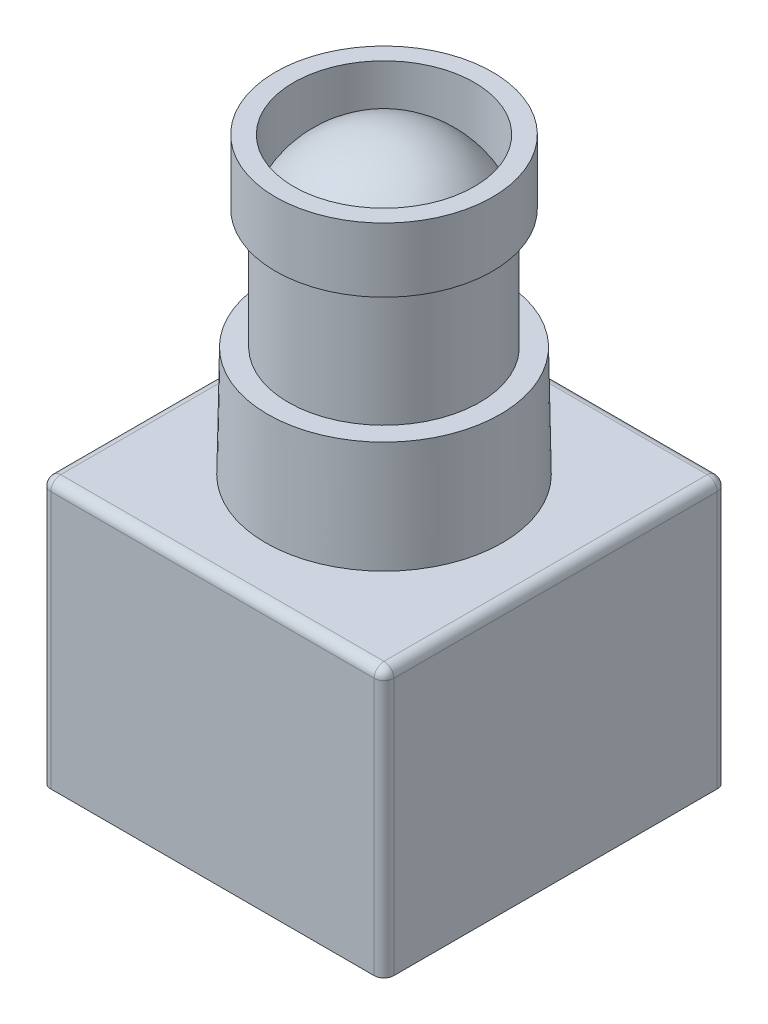
ISO-10303-21;
HEADER;
FILE_DESCRIPTION(('STEP AP214'),'2;1');
FILE_NAME('part.step','',(''),(''),'','','');
FILE_SCHEMA(('AUTOMOTIVE_DESIGN { 1 0 10303 214 1 1 1 1 }'));
ENDSEC;
DATA;
#1=APPLICATION_CONTEXT('core data for automotive mechanical design processes');
#2=APPLICATION_PROTOCOL_DEFINITION('international standard','automotive_design',2000,#1);
#3=PRODUCT_CONTEXT('',#1,'mechanical');
#4=PRODUCT('Part','Part','',(#3));
#5=PRODUCT_RELATED_PRODUCT_CATEGORY('part','',(#4));
#6=PRODUCT_DEFINITION_FORMATION('','',#4);
#7=PRODUCT_DEFINITION_CONTEXT('part definition',#1,'design');
#8=PRODUCT_DEFINITION('design','',#6,#7);
#9=PRODUCT_DEFINITION_SHAPE('','',#8);
#10=(LENGTH_UNIT() NAMED_UNIT(*) SI_UNIT(.MILLI.,.METRE.));
#11=(NAMED_UNIT(*) PLANE_ANGLE_UNIT() SI_UNIT($,.RADIAN.));
#12=(NAMED_UNIT(*) SI_UNIT($,.STERADIAN.) SOLID_ANGLE_UNIT());
#13=UNCERTAINTY_MEASURE_WITH_UNIT(LENGTH_MEASURE(1.E-05),#10,'distance_accuracy_value','');
#14=(GEOMETRIC_REPRESENTATION_CONTEXT(3) GLOBAL_UNCERTAINTY_ASSIGNED_CONTEXT((#13)) GLOBAL_UNIT_ASSIGNED_CONTEXT((#10,
#11,#12)) REPRESENTATION_CONTEXT('',''));
#15=CARTESIAN_POINT('',(0.,0.,0.));
#16=DIRECTION('',(0.,0.,1.));
#17=DIRECTION('',(1.,0.,0.));
#18=AXIS2_PLACEMENT_3D('',#15,#16,#17);
#19=CARTESIAN_POINT('',(11.049,24.3332,-11.049));
#20=DIRECTION('',(0.,1.,0.));
#21=DIRECTION('',(0.,0.,1.));
#22=AXIS2_PLACEMENT_3D('',#19,#20,#21);
#23=PLANE('',#22);
#24=CARTESIAN_POINT('',(11.049,24.3332,-11.049));
#25=DIRECTION('',(0.,1.,0.));
#26=DIRECTION('',(0.,0.,1.));
#27=AXIS2_PLACEMENT_3D('',#24,#25,#26);
#28=CIRCLE('',#27,7.49585957823051);
#29=CARTESIAN_POINT('',(11.049,24.3332,-3.55314042176949));
#30=VERTEX_POINT('',#29);
#31=EDGE_CURVE('E121',#30,#30,#28,.T.);
#32=ORIENTED_EDGE('',*,*,#31,.T.);
#33=EDGE_LOOP('',(#32));
#34=FACE_BOUND('',#33,.T.);
#35=CARTESIAN_POINT('',(11.049,24.3332,-11.049));
#36=DIRECTION('',(0.,1.,0.));
#37=DIRECTION('',(0.,0.,1.));
#38=AXIS2_PLACEMENT_3D('',#35,#36,#37);
#39=CIRCLE('',#38,6.16511776478347);
#40=CARTESIAN_POINT('',(11.049,24.3332,-4.88388223521653));
#41=VERTEX_POINT('',#40);
#42=EDGE_CURVE('E497',#41,#41,#39,.T.);
#43=ORIENTED_EDGE('',*,*,#42,.F.);
#44=EDGE_LOOP('',(#43));
#45=FACE_BOUND('',#44,.T.);
#46=ADVANCED_FACE('F32',(#34,#45),#23,.T.);
#47=CARTESIAN_POINT('',(0.,17.2212,-22.098));
#48=DIRECTION('',(0.,-1.,0.));
#49=DIRECTION('',(0.,0.,-1.));
#50=AXIS2_PLACEMENT_3D('',#47,#48,#49);
#51=PLANE('',#50);
#52=DIRECTION('',(0.,0.,-1.));
#53=VECTOR('',#52,1.);
#54=CARTESIAN_POINT('',(21.463,17.2212,-22.098));
#55=LINE('',#54,#53);
#56=CARTESIAN_POINT('',(21.463,17.2212,-0.635));
#57=VERTEX_POINT('',#56);
#58=CARTESIAN_POINT('',(21.463,17.2212,-21.463));
#59=VERTEX_POINT('',#58);
#60=EDGE_CURVE('E145',#57,#59,#55,.T.);
#61=ORIENTED_EDGE('',*,*,#60,.T.);
#62=DIRECTION('',(-1.,0.,0.));
#63=VECTOR('',#62,1.);
#64=CARTESIAN_POINT('',(0.,17.2212,-21.463));
#65=LINE('',#64,#63);
#66=CARTESIAN_POINT('',(0.634999999999993,17.2212,-21.463));
#67=VERTEX_POINT('',#66);
#68=EDGE_CURVE('E115',#59,#67,#65,.T.);
#69=ORIENTED_EDGE('',*,*,#68,.T.);
#70=DIRECTION('',(0.,0.,1.));
#71=VECTOR('',#70,1.);
#72=CARTESIAN_POINT('',(0.634999999999993,17.2212,-22.098));
#73=LINE('',#72,#71);
#74=CARTESIAN_POINT('',(0.635,17.2212,-0.635));
#75=VERTEX_POINT('',#74);
#76=EDGE_CURVE('E133',#67,#75,#73,.T.);
#77=ORIENTED_EDGE('',*,*,#76,.T.);
#78=DIRECTION('',(1.,0.,0.));
#79=VECTOR('',#78,1.);
#80=CARTESIAN_POINT('',(0.,17.2212,-0.635));
#81=LINE('',#80,#79);
#82=EDGE_CURVE('E139',#75,#57,#81,.T.);
#83=ORIENTED_EDGE('',*,*,#82,.T.);
#84=EDGE_LOOP('',(#61,#69,#77,#83));
#85=FACE_BOUND('',#84,.T.);
#86=CARTESIAN_POINT('',(11.049,17.2212,-11.049));
#87=DIRECTION('',(0.,-1.,0.));
#88=DIRECTION('',(0.,0.,-1.));
#89=AXIS2_PLACEMENT_3D('',#86,#87,#88);
#90=CIRCLE('',#89,7.62);
#91=CARTESIAN_POINT('',(11.049,17.2212,-18.669));
#92=VERTEX_POINT('',#91);
#93=EDGE_CURVE('E11',#92,#92,#90,.F.);
#94=ORIENTED_EDGE('',*,*,#93,.F.);
#95=EDGE_LOOP('',(#94));
#96=FACE_BOUND('',#95,.T.);
#97=ADVANCED_FACE('F142',(#85,#96),#51,.F.);
#98=CARTESIAN_POINT('',(0.,17.2212,0.));
#99=DIRECTION('',(1.,0.,0.));
#100=DIRECTION('',(0.,0.,-1.));
#101=AXIS2_PLACEMENT_3D('',#98,#99,#100);
#102=PLANE('',#101);
#103=DIRECTION('',(0.,0.,1.));
#104=VECTOR('',#103,1.);
#105=CARTESIAN_POINT('',(0.,16.5862,0.));
#106=LINE('',#105,#104);
#107=CARTESIAN_POINT('',(0.,16.5862,-0.635));
#108=VERTEX_POINT('',#107);
#109=CARTESIAN_POINT('',(0.,16.5862,-21.463));
#110=VERTEX_POINT('',#109);
#111=EDGE_CURVE('E48',#108,#110,#106,.F.);
#112=ORIENTED_EDGE('',*,*,#111,.T.);
#113=DIRECTION('',(0.,-1.,0.));
#114=VECTOR('',#113,1.);
#115=CARTESIAN_POINT('',(0.,17.2212,-21.463));
#116=LINE('',#115,#114);
#117=CARTESIAN_POINT('',(0.,0.,-21.463));
#118=VERTEX_POINT('',#117);
#119=EDGE_CURVE('E170',#110,#118,#116,.T.);
#120=ORIENTED_EDGE('',*,*,#119,.T.);
#121=DIRECTION('',(0.,0.,1.));
#122=VECTOR('',#121,1.);
#123=CARTESIAN_POINT('',(0.,0.,0.));
#124=LINE('',#123,#122);
#125=CARTESIAN_POINT('',(0.,0.,-0.635));
#126=VERTEX_POINT('',#125);
#127=EDGE_CURVE('E201',#118,#126,#124,.T.);
#128=ORIENTED_EDGE('',*,*,#127,.T.);
#129=DIRECTION('',(0.,-1.,0.));
#130=VECTOR('',#129,1.);
#131=CARTESIAN_POINT('',(0.,17.2212,-0.635));
#132=LINE('',#131,#130);
#133=EDGE_CURVE('E53',#126,#108,#132,.F.);
#134=ORIENTED_EDGE('',*,*,#133,.T.);
#135=EDGE_LOOP('',(#112,#120,#128,#134));
#136=FACE_BOUND('',#135,.T.);
#137=ADVANCED_FACE('F242',(#136),#102,.F.);
#138=CARTESIAN_POINT('',(0.,17.2212,0.));
#139=DIRECTION('',(0.,0.,-1.));
#140=DIRECTION('',(-1.,0.,0.));
#141=AXIS2_PLACEMENT_3D('',#138,#139,#140);
#142=PLANE('',#141);
#143=DIRECTION('',(1.,0.,0.));
#144=VECTOR('',#143,1.);
#145=CARTESIAN_POINT('',(0.,0.,0.));
#146=LINE('',#145,#144);
#147=CARTESIAN_POINT('',(0.635,0.,0.));
#148=VERTEX_POINT('',#147);
#149=CARTESIAN_POINT('',(21.463,0.,0.));
#150=VERTEX_POINT('',#149);
#151=EDGE_CURVE('E205',#148,#150,#146,.T.);
#152=ORIENTED_EDGE('',*,*,#151,.T.);
#153=DIRECTION('',(0.,-1.,0.));
#154=VECTOR('',#153,1.);
#155=CARTESIAN_POINT('',(21.463,17.2212,0.));
#156=LINE('',#155,#154);
#157=CARTESIAN_POINT('',(21.463,16.5862,0.));
#158=VERTEX_POINT('',#157);
#159=EDGE_CURVE('E166',#150,#158,#156,.F.);
#160=ORIENTED_EDGE('',*,*,#159,.T.);
#161=DIRECTION('',(1.,0.,0.));
#162=VECTOR('',#161,1.);
#163=CARTESIAN_POINT('',(0.,16.5862,0.));
#164=LINE('',#163,#162);
#165=CARTESIAN_POINT('',(0.635,16.5862,0.));
#166=VERTEX_POINT('',#165);
#167=EDGE_CURVE('E164',#158,#166,#164,.F.);
#168=ORIENTED_EDGE('',*,*,#167,.T.);
#169=DIRECTION('',(0.,-1.,0.));
#170=VECTOR('',#169,1.);
#171=CARTESIAN_POINT('',(0.635,17.2212,0.));
#172=LINE('',#171,#170);
#173=EDGE_CURVE('E162',#166,#148,#172,.T.);
#174=ORIENTED_EDGE('',*,*,#173,.T.);
#175=EDGE_LOOP('',(#152,#160,#168,#174));
#176=FACE_BOUND('',#175,.T.);
#177=ADVANCED_FACE('F285',(#176),#142,.F.);
#178=CARTESIAN_POINT('',(22.098,17.2212,0.));
#179=DIRECTION('',(-1.,0.,0.));
#180=DIRECTION('',(0.,0.,1.));
#181=AXIS2_PLACEMENT_3D('',#178,#179,#180);
#182=PLANE('',#181);
#183=DIRECTION('',(0.,0.,-1.));
#184=VECTOR('',#183,1.);
#185=CARTESIAN_POINT('',(22.098,0.,0.));
#186=LINE('',#185,#184);
#187=CARTESIAN_POINT('',(22.098,0.,-0.635));
#188=VERTEX_POINT('',#187);
#189=CARTESIAN_POINT('',(22.098,0.,-21.463));
#190=VERTEX_POINT('',#189);
#191=EDGE_CURVE('E209',#188,#190,#186,.T.);
#192=ORIENTED_EDGE('',*,*,#191,.T.);
#193=DIRECTION('',(0.,-1.,0.));
#194=VECTOR('',#193,1.);
#195=CARTESIAN_POINT('',(22.098,17.2212,-21.463));
#196=LINE('',#195,#194);
#197=CARTESIAN_POINT('',(22.098,16.5862,-21.463));
#198=VERTEX_POINT('',#197);
#199=EDGE_CURVE('E160',#190,#198,#196,.F.);
#200=ORIENTED_EDGE('',*,*,#199,.T.);
#201=DIRECTION('',(0.,0.,-1.));
#202=VECTOR('',#201,1.);
#203=CARTESIAN_POINT('',(22.098,16.5862,0.));
#204=LINE('',#203,#202);
#205=CARTESIAN_POINT('',(22.098,16.5862,-0.635));
#206=VERTEX_POINT('',#205);
#207=EDGE_CURVE('E158',#198,#206,#204,.F.);
#208=ORIENTED_EDGE('',*,*,#207,.T.);
#209=DIRECTION('',(0.,-1.,0.));
#210=VECTOR('',#209,1.);
#211=CARTESIAN_POINT('',(22.098,17.2212,-0.635));
#212=LINE('',#211,#210);
#213=EDGE_CURVE('E156',#206,#188,#212,.T.);
#214=ORIENTED_EDGE('',*,*,#213,.T.);
#215=EDGE_LOOP('',(#192,#200,#208,#214));
#216=FACE_BOUND('',#215,.T.);
#217=ADVANCED_FACE('F282',(#216),#182,.F.);
#218=CARTESIAN_POINT('',(0.,17.2212,-22.098));
#219=DIRECTION('',(0.,0.,1.));
#220=DIRECTION('',(1.,0.,0.));
#221=AXIS2_PLACEMENT_3D('',#218,#219,#220);
#222=PLANE('',#221);
#223=DIRECTION('',(-1.,0.,0.));
#224=VECTOR('',#223,1.);
#225=CARTESIAN_POINT('',(0.,0.,-22.098));
#226=LINE('',#225,#224);
#227=CARTESIAN_POINT('',(21.463,0.,-22.098));
#228=VERTEX_POINT('',#227);
#229=CARTESIAN_POINT('',(0.634999999999993,0.,-22.098));
#230=VERTEX_POINT('',#229);
#231=EDGE_CURVE('E140',#228,#230,#226,.T.);
#232=ORIENTED_EDGE('',*,*,#231,.T.);
#233=DIRECTION('',(0.,-1.,0.));
#234=VECTOR('',#233,1.);
#235=CARTESIAN_POINT('',(0.634999999999993,17.2212,-22.098));
#236=LINE('',#235,#234);
#237=CARTESIAN_POINT('',(0.634999999999993,16.5862,-22.098));
#238=VERTEX_POINT('',#237);
#239=EDGE_CURVE('E154',#230,#238,#236,.F.);
#240=ORIENTED_EDGE('',*,*,#239,.T.);
#241=DIRECTION('',(-1.,0.,0.));
#242=VECTOR('',#241,1.);
#243=CARTESIAN_POINT('',(0.,16.5862,-22.098));
#244=LINE('',#243,#242);
#245=CARTESIAN_POINT('',(21.463,16.5862,-22.098));
#246=VERTEX_POINT('',#245);
#247=EDGE_CURVE('E117',#238,#246,#244,.F.);
#248=ORIENTED_EDGE('',*,*,#247,.T.);
#249=DIRECTION('',(0.,-1.,0.));
#250=VECTOR('',#249,1.);
#251=CARTESIAN_POINT('',(21.463,17.2212,-22.098));
#252=LINE('',#251,#250);
#253=EDGE_CURVE('E147',#246,#228,#252,.T.);
#254=ORIENTED_EDGE('',*,*,#253,.T.);
#255=EDGE_LOOP('',(#232,#240,#248,#254));
#256=FACE_BOUND('',#255,.T.);
#257=ADVANCED_FACE('F237',(#256),#222,.F.);
#258=CARTESIAN_POINT('',(0.,0.,-22.098));
#259=DIRECTION('',(0.,-1.,0.));
#260=DIRECTION('',(0.,0.,-1.));
#261=AXIS2_PLACEMENT_3D('',#258,#259,#260);
#262=PLANE('',#261);
#263=ORIENTED_EDGE('',*,*,#127,.F.);
#264=CARTESIAN_POINT('',(0.634999999999993,0.,-21.463));
#265=DIRECTION('',(0.,-1.,0.));
#266=DIRECTION('',(0.,0.,-1.));
#267=AXIS2_PLACEMENT_3D('',#264,#265,#266);
#268=CIRCLE('',#267,0.635);
#269=EDGE_CURVE('E41',#118,#230,#268,.T.);
#270=ORIENTED_EDGE('',*,*,#269,.T.);
#271=ORIENTED_EDGE('',*,*,#231,.F.);
#272=CARTESIAN_POINT('',(21.463,0.,-21.463));
#273=DIRECTION('',(0.,-1.,0.));
#274=DIRECTION('',(0.,0.,-1.));
#275=AXIS2_PLACEMENT_3D('',#272,#273,#274);
#276=CIRCLE('',#275,0.635);
#277=EDGE_CURVE('E176',#228,#190,#276,.T.);
#278=ORIENTED_EDGE('',*,*,#277,.T.);
#279=ORIENTED_EDGE('',*,*,#191,.F.);
#280=CARTESIAN_POINT('',(21.463,0.,-0.635));
#281=DIRECTION('',(0.,-1.,0.));
#282=DIRECTION('',(0.,0.,-1.));
#283=AXIS2_PLACEMENT_3D('',#280,#281,#282);
#284=CIRCLE('',#283,0.635);
#285=EDGE_CURVE('E174',#188,#150,#284,.T.);
#286=ORIENTED_EDGE('',*,*,#285,.T.);
#287=ORIENTED_EDGE('',*,*,#151,.F.);
#288=CARTESIAN_POINT('',(0.635,0.,-0.635));
#289=DIRECTION('',(0.,-1.,0.));
#290=DIRECTION('',(0.,0.,-1.));
#291=AXIS2_PLACEMENT_3D('',#288,#289,#290);
#292=CIRCLE('',#291,0.635);
#293=EDGE_CURVE('E172',#148,#126,#292,.T.);
#294=ORIENTED_EDGE('',*,*,#293,.T.);
#295=EDGE_LOOP('',(#263,#270,#271,#278,#279,#286,#287,#294));
#296=FACE_BOUND('',#295,.T.);
#297=ADVANCED_FACE('F244',(#296),#262,.T.);
#298=CARTESIAN_POINT('',(21.463,17.2212,-0.635));
#299=DIRECTION('',(0.,-1.,0.));
#300=DIRECTION('',(0.,0.,-1.));
#301=AXIS2_PLACEMENT_3D('',#298,#299,#300);
#302=CYLINDRICAL_SURFACE('',#301,0.635);
#303=ORIENTED_EDGE('',*,*,#285,.F.);
#304=ORIENTED_EDGE('',*,*,#213,.F.);
#305=CARTESIAN_POINT('',(21.463,16.5862,-0.635));
#306=DIRECTION('',(0.,1.,0.));
#307=DIRECTION('',(0.,0.,1.));
#308=AXIS2_PLACEMENT_3D('',#305,#306,#307);
#309=CIRCLE('',#308,0.635);
#310=EDGE_CURVE('E199',#158,#206,#309,.T.);
#311=ORIENTED_EDGE('',*,*,#310,.F.);
#312=ORIENTED_EDGE('',*,*,#159,.F.);
#313=EDGE_LOOP('',(#303,#304,#311,#312));
#314=FACE_BOUND('',#313,.T.);
#315=ADVANCED_FACE('F279',(#314),#302,.T.);
#316=CARTESIAN_POINT('',(0.,16.5862,-0.635));
#317=DIRECTION('',(1.,0.,0.));
#318=DIRECTION('',(0.,0.,-1.));
#319=AXIS2_PLACEMENT_3D('',#316,#317,#318);
#320=CYLINDRICAL_SURFACE('',#319,0.635);
#321=CARTESIAN_POINT('',(0.635,16.5862,-0.635));
#322=DIRECTION('',(-1.,0.,0.));
#323=DIRECTION('',(0.,0.,1.));
#324=AXIS2_PLACEMENT_3D('',#321,#322,#323);
#325=CIRCLE('',#324,0.635);
#326=EDGE_CURVE('E193',#166,#75,#325,.T.);
#327=ORIENTED_EDGE('',*,*,#326,.F.);
#328=ORIENTED_EDGE('',*,*,#167,.F.);
#329=CARTESIAN_POINT('',(21.463,16.5862,-0.635));
#330=DIRECTION('',(1.,0.,0.));
#331=DIRECTION('',(0.,0.,-1.));
#332=AXIS2_PLACEMENT_3D('',#329,#330,#331);
#333=CIRCLE('',#332,0.635);
#334=EDGE_CURVE('E196',#57,#158,#333,.T.);
#335=ORIENTED_EDGE('',*,*,#334,.F.);
#336=ORIENTED_EDGE('',*,*,#82,.F.);
#337=EDGE_LOOP('',(#327,#328,#335,#336));
#338=FACE_BOUND('',#337,.T.);
#339=ADVANCED_FACE('F221',(#338),#320,.T.);
#340=CARTESIAN_POINT('',(0.635,17.2212,-0.635));
#341=DIRECTION('',(0.,-1.,0.));
#342=DIRECTION('',(0.,0.,-1.));
#343=AXIS2_PLACEMENT_3D('',#340,#341,#342);
#344=CYLINDRICAL_SURFACE('',#343,0.635);
#345=ORIENTED_EDGE('',*,*,#293,.F.);
#346=ORIENTED_EDGE('',*,*,#173,.F.);
#347=CARTESIAN_POINT('',(0.635,16.5862,-0.635));
#348=DIRECTION('',(0.,1.,0.));
#349=DIRECTION('',(0.,0.,1.));
#350=AXIS2_PLACEMENT_3D('',#347,#348,#349);
#351=CIRCLE('',#350,0.635);
#352=EDGE_CURVE('E190',#108,#166,#351,.T.);
#353=ORIENTED_EDGE('',*,*,#352,.F.);
#354=ORIENTED_EDGE('',*,*,#133,.F.);
#355=EDGE_LOOP('',(#345,#346,#353,#354));
#356=FACE_BOUND('',#355,.T.);
#357=ADVANCED_FACE('F249',(#356),#344,.T.);
#358=CARTESIAN_POINT('',(21.463,16.5862,-0.635));
#359=DIRECTION('',(0.,0.,1.));
#360=DIRECTION('',(1.,0.,0.));
#361=AXIS2_PLACEMENT_3D('',#358,#359,#360);
#362=SPHERICAL_SURFACE('',#361,0.635);
#363=ORIENTED_EDGE('',*,*,#334,.T.);
#364=ORIENTED_EDGE('',*,*,#310,.T.);
#365=CARTESIAN_POINT('',(21.463,16.5862,-0.635));
#366=DIRECTION('',(0.,0.,1.));
#367=DIRECTION('',(1.,0.,0.));
#368=AXIS2_PLACEMENT_3D('',#365,#366,#367);
#369=CIRCLE('',#368,0.635);
#370=EDGE_CURVE('E187',#57,#206,#369,.F.);
#371=ORIENTED_EDGE('',*,*,#370,.F.);
#372=EDGE_LOOP('',(#363,#364,#371));
#373=FACE_BOUND('',#372,.T.);
#374=ADVANCED_FACE('F222',(#373),#362,.T.);
#375=CARTESIAN_POINT('',(0.635,16.5862,-0.635));
#376=DIRECTION('',(0.,0.,1.));
#377=DIRECTION('',(1.,0.,0.));
#378=AXIS2_PLACEMENT_3D('',#375,#376,#377);
#379=SPHERICAL_SURFACE('',#378,0.635);
#380=ORIENTED_EDGE('',*,*,#352,.T.);
#381=ORIENTED_EDGE('',*,*,#326,.T.);
#382=CARTESIAN_POINT('',(0.635,16.5862,-0.635));
#383=DIRECTION('',(0.,0.,1.));
#384=DIRECTION('',(1.,0.,0.));
#385=AXIS2_PLACEMENT_3D('',#382,#383,#384);
#386=CIRCLE('',#385,0.635);
#387=EDGE_CURVE('E136',#108,#75,#386,.F.);
#388=ORIENTED_EDGE('',*,*,#387,.F.);
#389=EDGE_LOOP('',(#380,#381,#388));
#390=FACE_BOUND('',#389,.T.);
#391=ADVANCED_FACE('F251',(#390),#379,.T.);
#392=CARTESIAN_POINT('',(21.463,17.2212,-21.463));
#393=DIRECTION('',(0.,-1.,0.));
#394=DIRECTION('',(0.,0.,-1.));
#395=AXIS2_PLACEMENT_3D('',#392,#393,#394);
#396=CYLINDRICAL_SURFACE('',#395,0.635);
#397=ORIENTED_EDGE('',*,*,#277,.F.);
#398=ORIENTED_EDGE('',*,*,#253,.F.);
#399=CARTESIAN_POINT('',(21.463,16.5862,-21.463));
#400=DIRECTION('',(0.,1.,0.));
#401=DIRECTION('',(0.,0.,1.));
#402=AXIS2_PLACEMENT_3D('',#399,#400,#401);
#403=CIRCLE('',#402,0.635);
#404=EDGE_CURVE('E183',#198,#246,#403,.T.);
#405=ORIENTED_EDGE('',*,*,#404,.F.);
#406=ORIENTED_EDGE('',*,*,#199,.F.);
#407=EDGE_LOOP('',(#397,#398,#405,#406));
#408=FACE_BOUND('',#407,.T.);
#409=ADVANCED_FACE('F234',(#408),#396,.T.);
#410=CARTESIAN_POINT('',(21.463,16.5862,-22.098));
#411=DIRECTION('',(0.,0.,-1.));
#412=DIRECTION('',(-1.,0.,0.));
#413=AXIS2_PLACEMENT_3D('',#410,#411,#412);
#414=CYLINDRICAL_SURFACE('',#413,0.635);
#415=ORIENTED_EDGE('',*,*,#370,.T.);
#416=ORIENTED_EDGE('',*,*,#207,.F.);
#417=CARTESIAN_POINT('',(21.463,16.5862,-21.463));
#418=DIRECTION('',(0.,0.,-1.));
#419=DIRECTION('',(-1.,0.,0.));
#420=AXIS2_PLACEMENT_3D('',#417,#418,#419);
#421=CIRCLE('',#420,0.635);
#422=EDGE_CURVE('E130',#59,#198,#421,.T.);
#423=ORIENTED_EDGE('',*,*,#422,.F.);
#424=ORIENTED_EDGE('',*,*,#60,.F.);
#425=EDGE_LOOP('',(#415,#416,#423,#424));
#426=FACE_BOUND('',#425,.T.);
#427=ADVANCED_FACE('F225',(#426),#414,.T.);
#428=CARTESIAN_POINT('',(0.634999999999993,16.5862,-22.098));
#429=DIRECTION('',(0.,0.,1.));
#430=DIRECTION('',(1.,0.,0.));
#431=AXIS2_PLACEMENT_3D('',#428,#429,#430);
#432=CYLINDRICAL_SURFACE('',#431,0.635);
#433=ORIENTED_EDGE('',*,*,#387,.T.);
#434=ORIENTED_EDGE('',*,*,#76,.F.);
#435=CARTESIAN_POINT('',(0.634999999999993,16.5862,-21.463));
#436=DIRECTION('',(0.,0.,-1.));
#437=DIRECTION('',(-1.,0.,0.));
#438=AXIS2_PLACEMENT_3D('',#435,#436,#437);
#439=CIRCLE('',#438,0.635);
#440=EDGE_CURVE('E124',#110,#67,#439,.T.);
#441=ORIENTED_EDGE('',*,*,#440,.F.);
#442=ORIENTED_EDGE('',*,*,#111,.F.);
#443=EDGE_LOOP('',(#433,#434,#441,#442));
#444=FACE_BOUND('',#443,.T.);
#445=ADVANCED_FACE('F134',(#444),#432,.T.);
#446=CARTESIAN_POINT('',(0.634999999999993,17.2212,-21.463));
#447=DIRECTION('',(0.,-1.,0.));
#448=DIRECTION('',(0.,0.,-1.));
#449=AXIS2_PLACEMENT_3D('',#446,#447,#448);
#450=CYLINDRICAL_SURFACE('',#449,0.635);
#451=ORIENTED_EDGE('',*,*,#269,.F.);
#452=ORIENTED_EDGE('',*,*,#119,.F.);
#453=CARTESIAN_POINT('',(0.634999999999993,16.5862,-21.463));
#454=DIRECTION('',(0.,1.,0.));
#455=DIRECTION('',(0.,0.,1.));
#456=AXIS2_PLACEMENT_3D('',#453,#454,#455);
#457=CIRCLE('',#456,0.635);
#458=EDGE_CURVE('E128',#238,#110,#457,.T.);
#459=ORIENTED_EDGE('',*,*,#458,.F.);
#460=ORIENTED_EDGE('',*,*,#239,.F.);
#461=EDGE_LOOP('',(#451,#452,#459,#460));
#462=FACE_BOUND('',#461,.T.);
#463=ADVANCED_FACE('F241',(#462),#450,.T.);
#464=CARTESIAN_POINT('',(21.463,16.5862,-21.463));
#465=DIRECTION('',(0.,0.,1.));
#466=DIRECTION('',(1.,0.,0.));
#467=AXIS2_PLACEMENT_3D('',#464,#465,#466);
#468=SPHERICAL_SURFACE('',#467,0.635);
#469=ORIENTED_EDGE('',*,*,#422,.T.);
#470=ORIENTED_EDGE('',*,*,#404,.T.);
#471=CARTESIAN_POINT('',(21.463,16.5862,-21.463));
#472=DIRECTION('',(1.,0.,0.));
#473=DIRECTION('',(0.,0.,-1.));
#474=AXIS2_PLACEMENT_3D('',#471,#472,#473);
#475=CIRCLE('',#474,0.635);
#476=EDGE_CURVE('E120',#59,#246,#475,.F.);
#477=ORIENTED_EDGE('',*,*,#476,.F.);
#478=EDGE_LOOP('',(#469,#470,#477));
#479=FACE_BOUND('',#478,.T.);
#480=ADVANCED_FACE('F229',(#479),#468,.T.);
#481=CARTESIAN_POINT('',(0.634999999999993,16.5862,-21.463));
#482=DIRECTION('',(0.,0.,1.));
#483=DIRECTION('',(1.,0.,0.));
#484=AXIS2_PLACEMENT_3D('',#481,#482,#483);
#485=SPHERICAL_SURFACE('',#484,0.635);
#486=ORIENTED_EDGE('',*,*,#458,.T.);
#487=ORIENTED_EDGE('',*,*,#440,.T.);
#488=CARTESIAN_POINT('',(0.634999999999993,16.5862,-21.463));
#489=DIRECTION('',(-1.,0.,0.));
#490=DIRECTION('',(0.,0.,1.));
#491=AXIS2_PLACEMENT_3D('',#488,#489,#490);
#492=CIRCLE('',#491,0.635);
#493=EDGE_CURVE('E111',#238,#67,#492,.F.);
#494=ORIENTED_EDGE('',*,*,#493,.F.);
#495=EDGE_LOOP('',(#486,#487,#494));
#496=FACE_BOUND('',#495,.T.);
#497=ADVANCED_FACE('F126',(#496),#485,.T.);
#498=CARTESIAN_POINT('',(0.,16.5862,-21.463));
#499=DIRECTION('',(-1.,0.,0.));
#500=DIRECTION('',(0.,0.,1.));
#501=AXIS2_PLACEMENT_3D('',#498,#499,#500);
#502=CYLINDRICAL_SURFACE('',#501,0.635);
#503=ORIENTED_EDGE('',*,*,#476,.T.);
#504=ORIENTED_EDGE('',*,*,#247,.F.);
#505=ORIENTED_EDGE('',*,*,#493,.T.);
#506=ORIENTED_EDGE('',*,*,#68,.F.);
#507=EDGE_LOOP('',(#503,#504,#505,#506));
#508=FACE_BOUND('',#507,.T.);
#509=ADVANCED_FACE('F113',(#508),#502,.T.);
#510=CARTESIAN_POINT('',(11.049,17.2212,-11.049));
#511=DIRECTION('',(0.,-1.,0.));
#512=DIRECTION('',(0.,0.,1.));
#513=AXIS2_PLACEMENT_3D('',#510,#511,#512);
#514=CONICAL_SURFACE('',#513,7.62,0.0174532925199434);
#515=ORIENTED_EDGE('',*,*,#31,.F.);
#516=EDGE_LOOP('',(#515));
#517=FACE_BOUND('',#516,.T.);
#518=ORIENTED_EDGE('',*,*,#93,.T.);
#519=EDGE_LOOP('',(#518));
#520=FACE_BOUND('',#519,.T.);
#521=ADVANCED_FACE('F273',(#517,#520),#514,.T.);
#522=CARTESIAN_POINT('',(11.049,32.0548,-11.049));
#523=DIRECTION('',(0.,-1.,0.));
#524=DIRECTION('',(0.,0.,-1.));
#525=AXIS2_PLACEMENT_3D('',#522,#523,#524);
#526=CYLINDRICAL_SURFACE('',#525,6.16511776478347);
#527=CARTESIAN_POINT('',(11.049,32.0548,-11.049));
#528=DIRECTION('',(0.,1.,0.));
#529=DIRECTION('',(0.,0.,1.));
#530=AXIS2_PLACEMENT_3D('',#527,#528,#529);
#531=CIRCLE('',#530,6.16511776478347);
#532=CARTESIAN_POINT('',(11.049,32.0548,-4.88388223521653));
#533=VERTEX_POINT('',#532);
#534=EDGE_CURVE('E499',#533,#533,#531,.T.);
#535=ORIENTED_EDGE('',*,*,#534,.F.);
#536=EDGE_LOOP('',(#535));
#537=FACE_BOUND('',#536,.T.);
#538=ORIENTED_EDGE('',*,*,#42,.T.);
#539=EDGE_LOOP('',(#538));
#540=FACE_BOUND('',#539,.T.);
#541=ADVANCED_FACE('F271',(#537,#540),#526,.T.);
#542=CARTESIAN_POINT('',(11.049,32.0548,-11.049));
#543=DIRECTION('',(0.,1.,0.));
#544=DIRECTION('',(0.,0.,1.));
#545=AXIS2_PLACEMENT_3D('',#542,#543,#544);
#546=PLANE('',#545);
#547=CARTESIAN_POINT('',(11.049,32.0548,-11.049));
#548=DIRECTION('',(0.,1.,0.));
#549=DIRECTION('',(0.,0.,1.));
#550=AXIS2_PLACEMENT_3D('',#547,#548,#549);
#551=CIRCLE('',#550,6.985);
#552=CARTESIAN_POINT('',(11.049,32.0548,-4.064));
#553=VERTEX_POINT('',#552);
#554=EDGE_CURVE('E486',#553,#553,#551,.T.);
#555=ORIENTED_EDGE('',*,*,#554,.F.);
#556=EDGE_LOOP('',(#555));
#557=FACE_BOUND('',#556,.T.);
#558=ORIENTED_EDGE('',*,*,#534,.T.);
#559=EDGE_LOOP('',(#558));
#560=FACE_BOUND('',#559,.T.);
#561=ADVANCED_FACE('F338',(#557,#560),#546,.F.);
#562=CARTESIAN_POINT('',(11.049,36.195,-11.049));
#563=DIRECTION('',(0.,-1.,0.));
#564=DIRECTION('',(0.,0.,-1.));
#565=AXIS2_PLACEMENT_3D('',#562,#563,#564);
#566=CYLINDRICAL_SURFACE('',#565,6.985);
#567=CARTESIAN_POINT('',(11.049,36.195,-11.049));
#568=DIRECTION('',(0.,1.,0.));
#569=DIRECTION('',(0.,0.,1.));
#570=AXIS2_PLACEMENT_3D('',#567,#568,#569);
#571=CIRCLE('',#570,6.985);
#572=CARTESIAN_POINT('',(11.049,36.195,-4.064));
#573=VERTEX_POINT('',#572);
#574=EDGE_CURVE('E489',#573,#573,#571,.T.);
#575=ORIENTED_EDGE('',*,*,#574,.F.);
#576=EDGE_LOOP('',(#575));
#577=FACE_BOUND('',#576,.T.);
#578=ORIENTED_EDGE('',*,*,#554,.T.);
#579=EDGE_LOOP('',(#578));
#580=FACE_BOUND('',#579,.T.);
#581=ADVANCED_FACE('F345',(#577,#580),#566,.T.);
#582=CARTESIAN_POINT('',(11.049,36.195,-11.049));
#583=DIRECTION('',(0.,1.,0.));
#584=DIRECTION('',(0.,0.,1.));
#585=AXIS2_PLACEMENT_3D('',#582,#583,#584);
#586=PLANE('',#585);
#587=CARTESIAN_POINT('',(11.049,36.195,-11.049));
#588=DIRECTION('',(0.,1.,0.));
#589=DIRECTION('',(0.,0.,1.));
#590=AXIS2_PLACEMENT_3D('',#587,#588,#589);
#591=CIRCLE('',#590,5.81722973381968);
#592=CARTESIAN_POINT('',(11.049,36.195,-5.23177026618032));
#593=VERTEX_POINT('',#592);
#594=EDGE_CURVE('E487',#593,#593,#591,.T.);
#595=ORIENTED_EDGE('',*,*,#594,.F.);
#596=EDGE_LOOP('',(#595));
#597=FACE_BOUND('',#596,.T.);
#598=ORIENTED_EDGE('',*,*,#574,.T.);
#599=EDGE_LOOP('',(#598));
#600=FACE_BOUND('',#599,.T.);
#601=ADVANCED_FACE('F353',(#597,#600),#586,.T.);
#602=CARTESIAN_POINT('',(11.049,32.512,-11.049));
#603=DIRECTION('',(0.,1.,0.));
#604=DIRECTION('',(0.,0.,1.));
#605=AXIS2_PLACEMENT_3D('',#602,#603,#604);
#606=CYLINDRICAL_SURFACE('',#605,5.81722973381968);
#607=CARTESIAN_POINT('',(11.049,32.512,-11.049));
#608=DIRECTION('',(0.,1.,0.));
#609=DIRECTION('',(0.,0.,1.));
#610=AXIS2_PLACEMENT_3D('',#607,#608,#609);
#611=CIRCLE('',#610,5.81722973381968);
#612=CARTESIAN_POINT('',(11.049,32.512,-5.23177026618032));
#613=VERTEX_POINT('',#612);
#614=EDGE_CURVE('E36',#613,#613,#611,.T.);
#615=ORIENTED_EDGE('',*,*,#614,.F.);
#616=EDGE_LOOP('',(#615));
#617=FACE_BOUND('',#616,.T.);
#618=ORIENTED_EDGE('',*,*,#594,.T.);
#619=EDGE_LOOP('',(#618));
#620=FACE_BOUND('',#619,.T.);
#621=ADVANCED_FACE('F360',(#617,#620),#606,.F.);
#622=CARTESIAN_POINT('',(11.049,29.7593971251648,-11.049));
#623=DIRECTION('',(0.,0.,1.));
#624=DIRECTION('',(1.,0.,0.));
#625=AXIS2_PLACEMENT_3D('',#622,#623,#624);
#626=SPHERICAL_SURFACE('',#625,6.43560287483516);
#627=CARTESIAN_POINT('',(11.049,29.7593971251648,-11.049));
#628=DIRECTION('',(0.,1.,0.));
#629=DIRECTION('',(0.,0.,1.));
#630=AXIS2_PLACEMENT_3D('',#627,#628,#629);
#631=SPHERICAL_SURFACE('',#630,6.43560287483516);
#632=ORIENTED_EDGE('',*,*,#614,.T.);
#633=EDGE_LOOP('',(#632));
#634=FACE_BOUND('',#633,.T.);
#635=ADVANCED_FACE('F34',(#634),#631,.T.);
#636=CLOSED_SHELL('',(#46,#97,#137,#177,#217,#257,#297,#315,#339,#357,#374,#391,#409,#427,#445,
#463,#480,#497,#509,#521,#541,#561,#581,#601,#621,#635));
#637=MANIFOLD_SOLID_BREP('B2',#636);
#638=ADVANCED_BREP_SHAPE_REPRESENTATION('',(#18,#637),#14);
#639=SHAPE_DEFINITION_REPRESENTATION(#9,#638);
ENDSEC;
END-ISO-10303-21;
